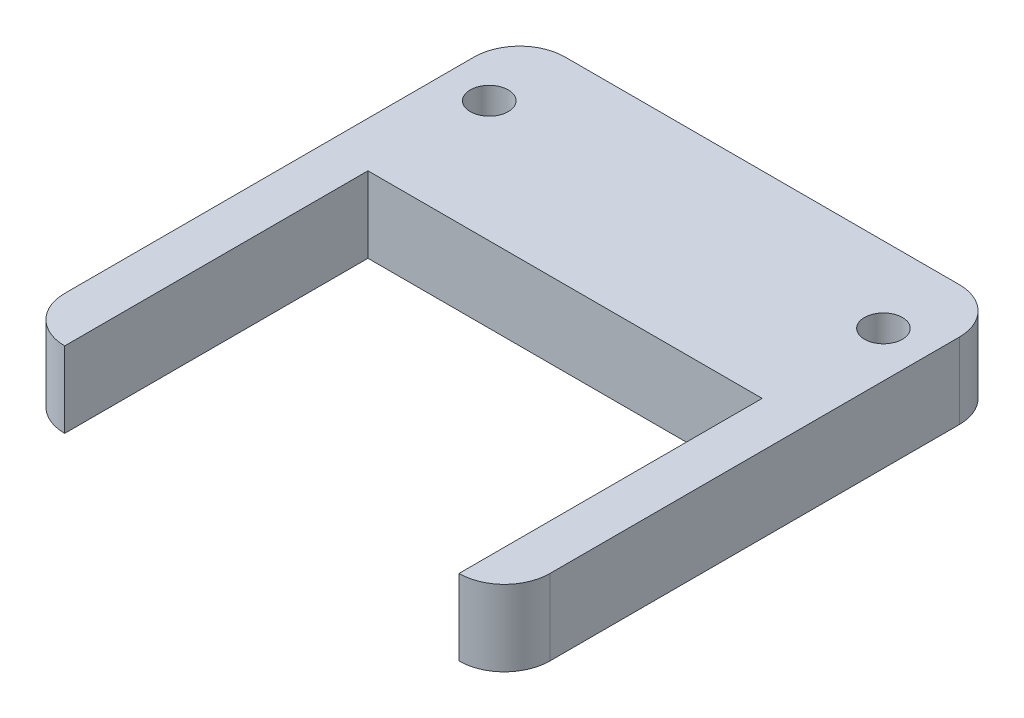
ISO-10303-21;
HEADER;
FILE_DESCRIPTION(('STEP AP214'),'2;1');
FILE_NAME('part.step','',(''),(''),'','','');
FILE_SCHEMA(('AUTOMOTIVE_DESIGN { 1 0 10303 214 1 1 1 1 }'));
ENDSEC;
DATA;
#1=APPLICATION_CONTEXT('core data for automotive mechanical design processes');
#2=APPLICATION_PROTOCOL_DEFINITION('international standard','automotive_design',2000,#1);
#3=PRODUCT_CONTEXT('',#1,'mechanical');
#4=PRODUCT('Part','Part','',(#3));
#5=PRODUCT_RELATED_PRODUCT_CATEGORY('part','',(#4));
#6=PRODUCT_DEFINITION_FORMATION('','',#4);
#7=PRODUCT_DEFINITION_CONTEXT('part definition',#1,'design');
#8=PRODUCT_DEFINITION('design','',#6,#7);
#9=PRODUCT_DEFINITION_SHAPE('','',#8);
#10=(LENGTH_UNIT() NAMED_UNIT(*) SI_UNIT(.MILLI.,.METRE.));
#11=(NAMED_UNIT(*) PLANE_ANGLE_UNIT() SI_UNIT($,.RADIAN.));
#12=(NAMED_UNIT(*) SI_UNIT($,.STERADIAN.) SOLID_ANGLE_UNIT());
#13=UNCERTAINTY_MEASURE_WITH_UNIT(LENGTH_MEASURE(1.E-05),#10,'distance_accuracy_value','');
#14=(GEOMETRIC_REPRESENTATION_CONTEXT(3) GLOBAL_UNCERTAINTY_ASSIGNED_CONTEXT((#13)) GLOBAL_UNIT_ASSIGNED_CONTEXT((#10,
#11,#12)) REPRESENTATION_CONTEXT('',''));
#15=CARTESIAN_POINT('',(0.,0.,0.));
#16=DIRECTION('',(0.,0.,1.));
#17=DIRECTION('',(1.,0.,0.));
#18=AXIS2_PLACEMENT_3D('',#15,#16,#17);
#19=CARTESIAN_POINT('',(0.,5.,0.));
#20=DIRECTION('',(0.,-1.,0.));
#21=DIRECTION('',(0.,0.,-1.));
#22=AXIS2_PLACEMENT_3D('',#19,#20,#21);
#23=PLANE('',#22);
#24=CARTESIAN_POINT('',(3.,5.,-28.));
#25=DIRECTION('',(0.,1.,0.));
#26=DIRECTION('',(0.,0.,1.));
#27=AXIS2_PLACEMENT_3D('',#24,#25,#26);
#28=CIRCLE('',#27,1.25);
#29=CARTESIAN_POINT('',(3.,5.,-26.75));
#30=VERTEX_POINT('',#29);
#31=EDGE_CURVE('E201',#30,#30,#28,.T.);
#32=ORIENTED_EDGE('',*,*,#31,.F.);
#33=EDGE_LOOP('',(#32));
#34=FACE_BOUND('',#33,.T.);
#35=DIRECTION('',(0.,0.,1.));
#36=VECTOR('',#35,1.);
#37=CARTESIAN_POINT('',(29.,5.,0.));
#38=LINE('',#37,#36);
#39=CARTESIAN_POINT('',(29.,5.,-20.));
#40=VERTEX_POINT('',#39);
#41=CARTESIAN_POINT('',(29.,5.,0.));
#42=VERTEX_POINT('',#41);
#43=EDGE_CURVE('E190',#40,#42,#38,.T.);
#44=ORIENTED_EDGE('',*,*,#43,.T.);
#45=CARTESIAN_POINT('',(29.,5.,-3.));
#46=DIRECTION('',(0.,-1.,0.));
#47=DIRECTION('',(0.,0.,-1.));
#48=AXIS2_PLACEMENT_3D('',#45,#46,#47);
#49=CIRCLE('',#48,3.);
#50=CARTESIAN_POINT('',(32.,5.,-3.));
#51=VERTEX_POINT('',#50);
#52=EDGE_CURVE('E121',#42,#51,#49,.F.);
#53=ORIENTED_EDGE('',*,*,#52,.T.);
#54=DIRECTION('',(0.,0.,-1.));
#55=VECTOR('',#54,1.);
#56=CARTESIAN_POINT('',(32.,5.,0.));
#57=LINE('',#56,#55);
#58=CARTESIAN_POINT('',(32.,5.,-30.));
#59=VERTEX_POINT('',#58);
#60=EDGE_CURVE('E203',#51,#59,#57,.T.);
#61=ORIENTED_EDGE('',*,*,#60,.T.);
#62=CARTESIAN_POINT('',(29.,5.,-30.));
#63=DIRECTION('',(0.,-1.,0.));
#64=DIRECTION('',(0.,0.,-1.));
#65=AXIS2_PLACEMENT_3D('',#62,#63,#64);
#66=CIRCLE('',#65,3.);
#67=CARTESIAN_POINT('',(29.,5.,-33.));
#68=VERTEX_POINT('',#67);
#69=EDGE_CURVE('E55',#59,#68,#66,.F.);
#70=ORIENTED_EDGE('',*,*,#69,.T.);
#71=DIRECTION('',(-1.,0.,0.));
#72=VECTOR('',#71,1.);
#73=CARTESIAN_POINT('',(0.,5.,-33.));
#74=LINE('',#73,#72);
#75=CARTESIAN_POINT('',(3.,5.,-33.));
#76=VERTEX_POINT('',#75);
#77=EDGE_CURVE('E165',#68,#76,#74,.T.);
#78=ORIENTED_EDGE('',*,*,#77,.T.);
#79=CARTESIAN_POINT('',(3.,5.,-30.));
#80=DIRECTION('',(0.,-1.,0.));
#81=DIRECTION('',(0.,0.,-1.));
#82=AXIS2_PLACEMENT_3D('',#79,#80,#81);
#83=CIRCLE('',#82,3.);
#84=CARTESIAN_POINT('',(0.,5.,-30.));
#85=VERTEX_POINT('',#84);
#86=EDGE_CURVE('E122',#76,#85,#83,.F.);
#87=ORIENTED_EDGE('',*,*,#86,.T.);
#88=DIRECTION('',(0.,0.,1.));
#89=VECTOR('',#88,1.);
#90=CARTESIAN_POINT('',(0.,5.,0.));
#91=LINE('',#90,#89);
#92=CARTESIAN_POINT('',(0.,5.,-3.));
#93=VERTEX_POINT('',#92);
#94=EDGE_CURVE('E117',#85,#93,#91,.T.);
#95=ORIENTED_EDGE('',*,*,#94,.T.);
#96=CARTESIAN_POINT('',(3.,5.,-3.));
#97=DIRECTION('',(0.,-1.,0.));
#98=DIRECTION('',(0.,0.,-1.));
#99=AXIS2_PLACEMENT_3D('',#96,#97,#98);
#100=CIRCLE('',#99,3.);
#101=CARTESIAN_POINT('',(3.,5.,0.));
#102=VERTEX_POINT('',#101);
#103=EDGE_CURVE('E111',#93,#102,#100,.F.);
#104=ORIENTED_EDGE('',*,*,#103,.T.);
#105=DIRECTION('',(0.,0.,-1.));
#106=VECTOR('',#105,1.);
#107=CARTESIAN_POINT('',(3.,5.,0.));
#108=LINE('',#107,#106);
#109=CARTESIAN_POINT('',(3.,5.,-20.));
#110=VERTEX_POINT('',#109);
#111=EDGE_CURVE('E114',#102,#110,#108,.T.);
#112=ORIENTED_EDGE('',*,*,#111,.T.);
#113=DIRECTION('',(1.,0.,0.));
#114=VECTOR('',#113,1.);
#115=CARTESIAN_POINT('',(3.,5.,-20.));
#116=LINE('',#115,#114);
#117=EDGE_CURVE('E132',#110,#40,#116,.T.);
#118=ORIENTED_EDGE('',*,*,#117,.T.);
#119=EDGE_LOOP('',(#44,#53,#61,#70,#78,#87,#95,#104,#112,#118));
#120=FACE_BOUND('',#119,.T.);
#121=CARTESIAN_POINT('',(29.,5.,-28.));
#122=DIRECTION('',(0.,1.,0.));
#123=DIRECTION('',(0.,0.,1.));
#124=AXIS2_PLACEMENT_3D('',#121,#122,#123);
#125=CIRCLE('',#124,1.25);
#126=CARTESIAN_POINT('',(29.,5.,-26.75));
#127=VERTEX_POINT('',#126);
#128=EDGE_CURVE('E210',#127,#127,#125,.T.);
#129=ORIENTED_EDGE('',*,*,#128,.F.);
#130=EDGE_LOOP('',(#129));
#131=FACE_BOUND('',#130,.T.);
#132=ADVANCED_FACE('F35',(#34,#120,#131),#23,.F.);
#133=CARTESIAN_POINT('',(0.,0.,0.));
#134=DIRECTION('',(0.,-1.,0.));
#135=DIRECTION('',(0.,0.,-1.));
#136=AXIS2_PLACEMENT_3D('',#133,#134,#135);
#137=PLANE('',#136);
#138=CARTESIAN_POINT('',(3.,0.,-28.));
#139=DIRECTION('',(0.,1.,0.));
#140=DIRECTION('',(0.,0.,1.));
#141=AXIS2_PLACEMENT_3D('',#138,#139,#140);
#142=CIRCLE('',#141,1.25);
#143=CARTESIAN_POINT('',(3.,0.,-26.75));
#144=VERTEX_POINT('',#143);
#145=EDGE_CURVE('E207',#144,#144,#142,.T.);
#146=ORIENTED_EDGE('',*,*,#145,.T.);
#147=EDGE_LOOP('',(#146));
#148=FACE_BOUND('',#147,.T.);
#149=DIRECTION('',(0.,0.,-1.));
#150=VECTOR('',#149,1.);
#151=CARTESIAN_POINT('',(32.,0.,0.));
#152=LINE('',#151,#150);
#153=CARTESIAN_POINT('',(32.,0.,-3.));
#154=VERTEX_POINT('',#153);
#155=CARTESIAN_POINT('',(32.,0.,-30.));
#156=VERTEX_POINT('',#155);
#157=EDGE_CURVE('E173',#154,#156,#152,.T.);
#158=ORIENTED_EDGE('',*,*,#157,.F.);
#159=CARTESIAN_POINT('',(29.,0.,-3.));
#160=DIRECTION('',(0.,-1.,0.));
#161=DIRECTION('',(0.,0.,-1.));
#162=AXIS2_PLACEMENT_3D('',#159,#160,#161);
#163=CIRCLE('',#162,3.);
#164=CARTESIAN_POINT('',(29.,0.,0.));
#165=VERTEX_POINT('',#164);
#166=EDGE_CURVE('E151',#154,#165,#163,.T.);
#167=ORIENTED_EDGE('',*,*,#166,.T.);
#168=DIRECTION('',(0.,0.,1.));
#169=VECTOR('',#168,1.);
#170=CARTESIAN_POINT('',(29.,0.,0.));
#171=LINE('',#170,#169);
#172=CARTESIAN_POINT('',(29.,0.,-20.));
#173=VERTEX_POINT('',#172);
#174=EDGE_CURVE('E176',#173,#165,#171,.T.);
#175=ORIENTED_EDGE('',*,*,#174,.F.);
#176=DIRECTION('',(1.,0.,0.));
#177=VECTOR('',#176,1.);
#178=CARTESIAN_POINT('',(3.,0.,-20.));
#179=LINE('',#178,#177);
#180=CARTESIAN_POINT('',(3.,0.,-20.));
#181=VERTEX_POINT('',#180);
#182=EDGE_CURVE('E193',#181,#173,#179,.T.);
#183=ORIENTED_EDGE('',*,*,#182,.F.);
#184=DIRECTION('',(0.,0.,-1.));
#185=VECTOR('',#184,1.);
#186=CARTESIAN_POINT('',(3.,0.,0.));
#187=LINE('',#186,#185);
#188=CARTESIAN_POINT('',(3.,0.,0.));
#189=VERTEX_POINT('',#188);
#190=EDGE_CURVE('E194',#189,#181,#187,.T.);
#191=ORIENTED_EDGE('',*,*,#190,.F.);
#192=CARTESIAN_POINT('',(3.,0.,-3.));
#193=DIRECTION('',(0.,-1.,0.));
#194=DIRECTION('',(0.,0.,-1.));
#195=AXIS2_PLACEMENT_3D('',#192,#193,#194);
#196=CIRCLE('',#195,3.);
#197=CARTESIAN_POINT('',(0.,0.,-3.));
#198=VERTEX_POINT('',#197);
#199=EDGE_CURVE('E135',#189,#198,#196,.T.);
#200=ORIENTED_EDGE('',*,*,#199,.T.);
#201=DIRECTION('',(0.,0.,1.));
#202=VECTOR('',#201,1.);
#203=CARTESIAN_POINT('',(0.,0.,0.));
#204=LINE('',#203,#202);
#205=CARTESIAN_POINT('',(0.,0.,-30.));
#206=VERTEX_POINT('',#205);
#207=EDGE_CURVE('E198',#206,#198,#204,.T.);
#208=ORIENTED_EDGE('',*,*,#207,.F.);
#209=CARTESIAN_POINT('',(3.,0.,-30.));
#210=DIRECTION('',(0.,-1.,0.));
#211=DIRECTION('',(0.,0.,-1.));
#212=AXIS2_PLACEMENT_3D('',#209,#210,#211);
#213=CIRCLE('',#212,3.);
#214=CARTESIAN_POINT('',(3.,0.,-33.));
#215=VERTEX_POINT('',#214);
#216=EDGE_CURVE('E148',#206,#215,#213,.T.);
#217=ORIENTED_EDGE('',*,*,#216,.T.);
#218=DIRECTION('',(-1.,0.,0.));
#219=VECTOR('',#218,1.);
#220=CARTESIAN_POINT('',(0.,0.,-33.));
#221=LINE('',#220,#219);
#222=CARTESIAN_POINT('',(29.,0.,-33.));
#223=VERTEX_POINT('',#222);
#224=EDGE_CURVE('E164',#223,#215,#221,.T.);
#225=ORIENTED_EDGE('',*,*,#224,.F.);
#226=CARTESIAN_POINT('',(29.,0.,-30.));
#227=DIRECTION('',(0.,-1.,0.));
#228=DIRECTION('',(0.,0.,-1.));
#229=AXIS2_PLACEMENT_3D('',#226,#227,#228);
#230=CIRCLE('',#229,3.);
#231=EDGE_CURVE('E146',#223,#156,#230,.T.);
#232=ORIENTED_EDGE('',*,*,#231,.T.);
#233=EDGE_LOOP('',(#158,#167,#175,#183,#191,#200,#208,#217,#225,#232));
#234=FACE_BOUND('',#233,.T.);
#235=CARTESIAN_POINT('',(29.,0.,-28.));
#236=DIRECTION('',(0.,1.,0.));
#237=DIRECTION('',(0.,0.,1.));
#238=AXIS2_PLACEMENT_3D('',#235,#236,#237);
#239=CIRCLE('',#238,1.25);
#240=CARTESIAN_POINT('',(29.,0.,-26.75));
#241=VERTEX_POINT('',#240);
#242=EDGE_CURVE('E213',#241,#241,#239,.T.);
#243=ORIENTED_EDGE('',*,*,#242,.T.);
#244=EDGE_LOOP('',(#243));
#245=FACE_BOUND('',#244,.T.);
#246=ADVANCED_FACE('F169',(#148,#234,#245),#137,.T.);
#247=CARTESIAN_POINT('',(0.,5.,0.));
#248=DIRECTION('',(1.,0.,0.));
#249=DIRECTION('',(0.,0.,-1.));
#250=AXIS2_PLACEMENT_3D('',#247,#248,#249);
#251=PLANE('',#250);
#252=ORIENTED_EDGE('',*,*,#207,.T.);
#253=DIRECTION('',(0.,-1.,0.));
#254=VECTOR('',#253,1.);
#255=CARTESIAN_POINT('',(0.,5.,-3.));
#256=LINE('',#255,#254);
#257=EDGE_CURVE('E159',#198,#93,#256,.F.);
#258=ORIENTED_EDGE('',*,*,#257,.T.);
#259=ORIENTED_EDGE('',*,*,#94,.F.);
#260=DIRECTION('',(0.,-1.,0.));
#261=VECTOR('',#260,1.);
#262=CARTESIAN_POINT('',(0.,5.,-30.));
#263=LINE('',#262,#261);
#264=EDGE_CURVE('E156',#85,#206,#263,.T.);
#265=ORIENTED_EDGE('',*,*,#264,.T.);
#266=EDGE_LOOP('',(#252,#258,#259,#265));
#267=FACE_BOUND('',#266,.T.);
#268=ADVANCED_FACE('F227',(#267),#251,.F.);
#269=CARTESIAN_POINT('',(3.,5.,0.));
#270=DIRECTION('',(-1.,0.,0.));
#271=DIRECTION('',(0.,0.,1.));
#272=AXIS2_PLACEMENT_3D('',#269,#270,#271);
#273=PLANE('',#272);
#274=ORIENTED_EDGE('',*,*,#190,.T.);
#275=DIRECTION('',(0.,-1.,0.));
#276=VECTOR('',#275,1.);
#277=CARTESIAN_POINT('',(3.,5.,-20.));
#278=LINE('',#277,#276);
#279=EDGE_CURVE('E130',#110,#181,#278,.T.);
#280=ORIENTED_EDGE('',*,*,#279,.F.);
#281=ORIENTED_EDGE('',*,*,#111,.F.);
#282=DIRECTION('',(0.,-1.,0.));
#283=VECTOR('',#282,1.);
#284=CARTESIAN_POINT('',(3.,5.,0.));
#285=LINE('',#284,#283);
#286=EDGE_CURVE('E127',#102,#189,#285,.T.);
#287=ORIENTED_EDGE('',*,*,#286,.T.);
#288=EDGE_LOOP('',(#274,#280,#281,#287));
#289=FACE_BOUND('',#288,.T.);
#290=ADVANCED_FACE('F126',(#289),#273,.F.);
#291=CARTESIAN_POINT('',(3.,5.,-20.));
#292=DIRECTION('',(0.,0.,-1.));
#293=DIRECTION('',(-1.,0.,0.));
#294=AXIS2_PLACEMENT_3D('',#291,#292,#293);
#295=PLANE('',#294);
#296=ORIENTED_EDGE('',*,*,#182,.T.);
#297=DIRECTION('',(0.,-1.,0.));
#298=VECTOR('',#297,1.);
#299=CARTESIAN_POINT('',(29.,5.,-20.));
#300=LINE('',#299,#298);
#301=EDGE_CURVE('E140',#40,#173,#300,.T.);
#302=ORIENTED_EDGE('',*,*,#301,.F.);
#303=ORIENTED_EDGE('',*,*,#117,.F.);
#304=ORIENTED_EDGE('',*,*,#279,.T.);
#305=EDGE_LOOP('',(#296,#302,#303,#304));
#306=FACE_BOUND('',#305,.T.);
#307=ADVANCED_FACE('F243',(#306),#295,.F.);
#308=CARTESIAN_POINT('',(29.,5.,0.));
#309=DIRECTION('',(1.,0.,0.));
#310=DIRECTION('',(0.,0.,-1.));
#311=AXIS2_PLACEMENT_3D('',#308,#309,#310);
#312=PLANE('',#311);
#313=ORIENTED_EDGE('',*,*,#174,.T.);
#314=DIRECTION('',(0.,-1.,0.));
#315=VECTOR('',#314,1.);
#316=CARTESIAN_POINT('',(29.,5.,0.));
#317=LINE('',#316,#315);
#318=EDGE_CURVE('E180',#42,#165,#317,.T.);
#319=ORIENTED_EDGE('',*,*,#318,.F.);
#320=ORIENTED_EDGE('',*,*,#43,.F.);
#321=ORIENTED_EDGE('',*,*,#301,.T.);
#322=EDGE_LOOP('',(#313,#319,#320,#321));
#323=FACE_BOUND('',#322,.T.);
#324=ADVANCED_FACE('F188',(#323),#312,.F.);
#325=CARTESIAN_POINT('',(32.,5.,0.));
#326=DIRECTION('',(-1.,0.,0.));
#327=DIRECTION('',(0.,0.,1.));
#328=AXIS2_PLACEMENT_3D('',#325,#326,#327);
#329=PLANE('',#328);
#330=ORIENTED_EDGE('',*,*,#60,.F.);
#331=DIRECTION('',(0.,-1.,0.));
#332=VECTOR('',#331,1.);
#333=CARTESIAN_POINT('',(32.,5.,-3.));
#334=LINE('',#333,#332);
#335=EDGE_CURVE('E138',#51,#154,#334,.T.);
#336=ORIENTED_EDGE('',*,*,#335,.T.);
#337=ORIENTED_EDGE('',*,*,#157,.T.);
#338=DIRECTION('',(0.,-1.,0.));
#339=VECTOR('',#338,1.);
#340=CARTESIAN_POINT('',(32.,5.,-30.));
#341=LINE('',#340,#339);
#342=EDGE_CURVE('E136',#156,#59,#341,.F.);
#343=ORIENTED_EDGE('',*,*,#342,.T.);
#344=EDGE_LOOP('',(#330,#336,#337,#343));
#345=FACE_BOUND('',#344,.T.);
#346=ADVANCED_FACE('F237',(#345),#329,.F.);
#347=CARTESIAN_POINT('',(0.,5.,-33.));
#348=DIRECTION('',(0.,0.,1.));
#349=DIRECTION('',(1.,0.,0.));
#350=AXIS2_PLACEMENT_3D('',#347,#348,#349);
#351=PLANE('',#350);
#352=ORIENTED_EDGE('',*,*,#224,.T.);
#353=DIRECTION('',(0.,-1.,0.));
#354=VECTOR('',#353,1.);
#355=CARTESIAN_POINT('',(3.,5.,-33.));
#356=LINE('',#355,#354);
#357=EDGE_CURVE('E11',#215,#76,#356,.F.);
#358=ORIENTED_EDGE('',*,*,#357,.T.);
#359=ORIENTED_EDGE('',*,*,#77,.F.);
#360=DIRECTION('',(0.,-1.,0.));
#361=VECTOR('',#360,1.);
#362=CARTESIAN_POINT('',(29.,5.,-33.));
#363=LINE('',#362,#361);
#364=EDGE_CURVE('E43',#68,#223,#363,.T.);
#365=ORIENTED_EDGE('',*,*,#364,.T.);
#366=EDGE_LOOP('',(#352,#358,#359,#365));
#367=FACE_BOUND('',#366,.T.);
#368=ADVANCED_FACE('F163',(#367),#351,.F.);
#369=CARTESIAN_POINT('',(3.,5.,-28.));
#370=DIRECTION('',(0.,-1.,0.));
#371=DIRECTION('',(0.,0.,-1.));
#372=AXIS2_PLACEMENT_3D('',#369,#370,#371);
#373=CYLINDRICAL_SURFACE('',#372,1.25);
#374=ORIENTED_EDGE('',*,*,#31,.T.);
#375=EDGE_LOOP('',(#374));
#376=FACE_BOUND('',#375,.T.);
#377=ORIENTED_EDGE('',*,*,#145,.F.);
#378=EDGE_LOOP('',(#377));
#379=FACE_BOUND('',#378,.T.);
#380=ADVANCED_FACE('F232',(#376,#379),#373,.F.);
#381=CARTESIAN_POINT('',(29.,5.,-28.));
#382=DIRECTION('',(0.,-1.,0.));
#383=DIRECTION('',(0.,0.,-1.));
#384=AXIS2_PLACEMENT_3D('',#381,#382,#383);
#385=CYLINDRICAL_SURFACE('',#384,1.25);
#386=ORIENTED_EDGE('',*,*,#128,.T.);
#387=EDGE_LOOP('',(#386));
#388=FACE_BOUND('',#387,.T.);
#389=ORIENTED_EDGE('',*,*,#242,.F.);
#390=EDGE_LOOP('',(#389));
#391=FACE_BOUND('',#390,.T.);
#392=ADVANCED_FACE('F219',(#388,#391),#385,.F.);
#393=CARTESIAN_POINT('',(29.,5.,-3.));
#394=DIRECTION('',(0.,-1.,0.));
#395=DIRECTION('',(0.,0.,-1.));
#396=AXIS2_PLACEMENT_3D('',#393,#394,#395);
#397=CYLINDRICAL_SURFACE('',#396,3.);
#398=ORIENTED_EDGE('',*,*,#52,.F.);
#399=ORIENTED_EDGE('',*,*,#318,.T.);
#400=ORIENTED_EDGE('',*,*,#166,.F.);
#401=ORIENTED_EDGE('',*,*,#335,.F.);
#402=EDGE_LOOP('',(#398,#399,#400,#401));
#403=FACE_BOUND('',#402,.T.);
#404=ADVANCED_FACE('F251',(#403),#397,.T.);
#405=CARTESIAN_POINT('',(3.,5.,-3.));
#406=DIRECTION('',(0.,-1.,0.));
#407=DIRECTION('',(0.,0.,-1.));
#408=AXIS2_PLACEMENT_3D('',#405,#406,#407);
#409=CYLINDRICAL_SURFACE('',#408,3.);
#410=ORIENTED_EDGE('',*,*,#103,.F.);
#411=ORIENTED_EDGE('',*,*,#257,.F.);
#412=ORIENTED_EDGE('',*,*,#199,.F.);
#413=ORIENTED_EDGE('',*,*,#286,.F.);
#414=EDGE_LOOP('',(#410,#411,#412,#413));
#415=FACE_BOUND('',#414,.T.);
#416=ADVANCED_FACE('F134',(#415),#409,.T.);
#417=CARTESIAN_POINT('',(3.,5.,-30.));
#418=DIRECTION('',(0.,-1.,0.));
#419=DIRECTION('',(0.,0.,-1.));
#420=AXIS2_PLACEMENT_3D('',#417,#418,#419);
#421=CYLINDRICAL_SURFACE('',#420,3.);
#422=ORIENTED_EDGE('',*,*,#86,.F.);
#423=ORIENTED_EDGE('',*,*,#357,.F.);
#424=ORIENTED_EDGE('',*,*,#216,.F.);
#425=ORIENTED_EDGE('',*,*,#264,.F.);
#426=EDGE_LOOP('',(#422,#423,#424,#425));
#427=FACE_BOUND('',#426,.T.);
#428=ADVANCED_FACE('F256',(#427),#421,.T.);
#429=CARTESIAN_POINT('',(29.,5.,-30.));
#430=DIRECTION('',(0.,-1.,0.));
#431=DIRECTION('',(0.,0.,-1.));
#432=AXIS2_PLACEMENT_3D('',#429,#430,#431);
#433=CYLINDRICAL_SURFACE('',#432,3.);
#434=ORIENTED_EDGE('',*,*,#69,.F.);
#435=ORIENTED_EDGE('',*,*,#342,.F.);
#436=ORIENTED_EDGE('',*,*,#231,.F.);
#437=ORIENTED_EDGE('',*,*,#364,.F.);
#438=EDGE_LOOP('',(#434,#435,#436,#437));
#439=FACE_BOUND('',#438,.T.);
#440=ADVANCED_FACE('F37',(#439),#433,.T.);
#441=CLOSED_SHELL('',(#132,#246,#268,#290,#307,#324,#346,#368,#380,#392,#404,#416,#428,#440));
#442=MANIFOLD_SOLID_BREP('B2',#441);
#443=ADVANCED_BREP_SHAPE_REPRESENTATION('',(#18,#442),#14);
#444=SHAPE_DEFINITION_REPRESENTATION(#9,#443);
ENDSEC;
END-ISO-10303-21;
